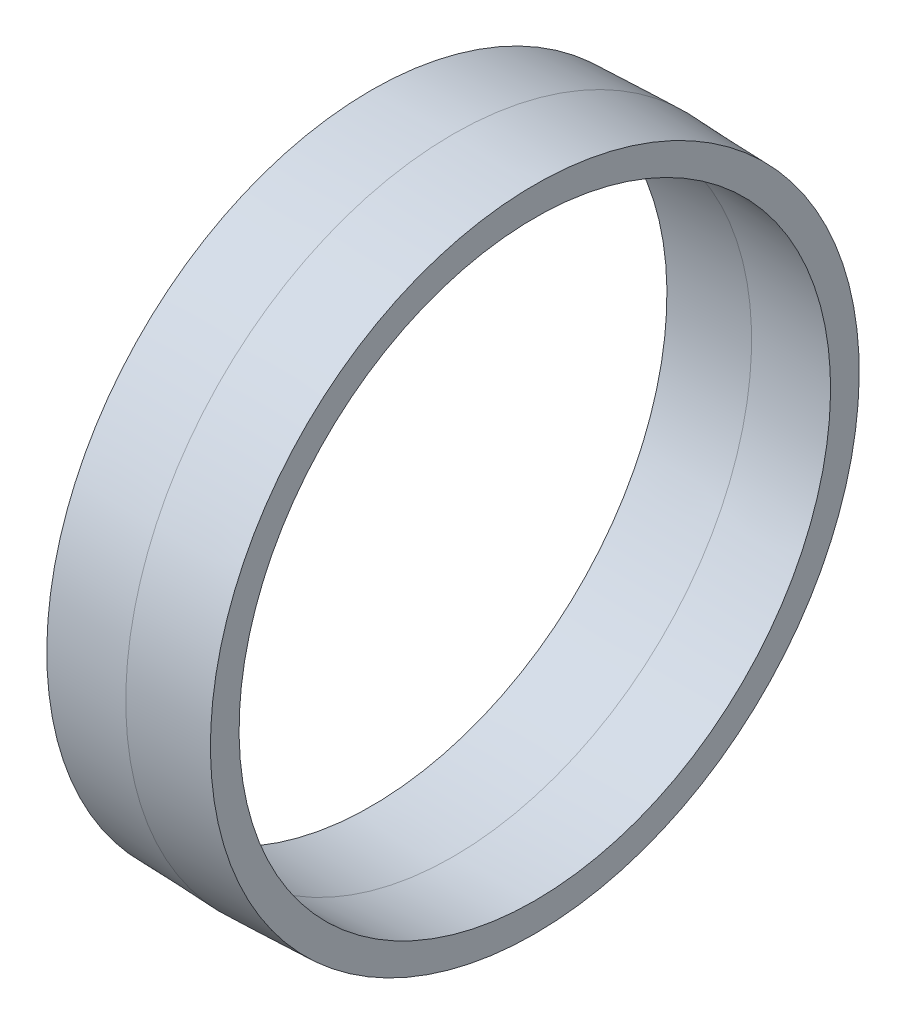
ISO-10303-21;
HEADER;
FILE_DESCRIPTION(('STEP AP214'),'2;1');
FILE_NAME('part.step','',(''),(''),'','','');
FILE_SCHEMA(('AUTOMOTIVE_DESIGN { 1 0 10303 214 1 1 1 1 }'));
ENDSEC;
DATA;
#1=APPLICATION_CONTEXT('core data for automotive mechanical design processes');
#2=APPLICATION_PROTOCOL_DEFINITION('international standard','automotive_design',2000,#1);
#3=PRODUCT_CONTEXT('',#1,'mechanical');
#4=PRODUCT('Part','Part','',(#3));
#5=PRODUCT_RELATED_PRODUCT_CATEGORY('part','',(#4));
#6=PRODUCT_DEFINITION_FORMATION('','',#4);
#7=PRODUCT_DEFINITION_CONTEXT('part definition',#1,'design');
#8=PRODUCT_DEFINITION('design','',#6,#7);
#9=PRODUCT_DEFINITION_SHAPE('','',#8);
#10=(LENGTH_UNIT() NAMED_UNIT(*) SI_UNIT(.MILLI.,.METRE.));
#11=(NAMED_UNIT(*) PLANE_ANGLE_UNIT() SI_UNIT($,.RADIAN.));
#12=(NAMED_UNIT(*) SI_UNIT($,.STERADIAN.) SOLID_ANGLE_UNIT());
#13=UNCERTAINTY_MEASURE_WITH_UNIT(LENGTH_MEASURE(1.E-05),#10,'distance_accuracy_value','');
#14=(GEOMETRIC_REPRESENTATION_CONTEXT(3) GLOBAL_UNCERTAINTY_ASSIGNED_CONTEXT((#13)) GLOBAL_UNIT_ASSIGNED_CONTEXT((#10,
#11,#12)) REPRESENTATION_CONTEXT('',''));
#15=CARTESIAN_POINT('',(0.,0.,0.));
#16=DIRECTION('',(0.,0.,1.));
#17=DIRECTION('',(1.,0.,0.));
#18=AXIS2_PLACEMENT_3D('',#15,#16,#17);
#19=CARTESIAN_POINT('',(-1.22406624605667,0.,0.));
#20=DIRECTION('',(1.,0.,0.));
#21=DIRECTION('',(0.,1.,0.));
#22=AXIS2_PLACEMENT_3D('',#19,#20,#21);
#23=CONICAL_SURFACE('',#22,46.355,0.0349065850398794);
#24=CARTESIAN_POINT('',(-1.22406624605675,0.,0.));
#25=DIRECTION('',(-1.,0.,0.));
#26=DIRECTION('',(0.,-1.,0.));
#27=AXIS2_PLACEMENT_3D('',#24,#25,#26);
#28=CIRCLE('',#27,46.355);
#29=CARTESIAN_POINT('',(-1.22406624605684,-46.355,0.));
#30=VERTEX_POINT('',#29);
#31=EDGE_CURVE('E29',#30,#30,#28,.F.);
#32=ORIENTED_EDGE('',*,*,#31,.T.);
#33=EDGE_LOOP('',(#32));
#34=FACE_BOUND('',#33,.T.);
#35=CARTESIAN_POINT('',(-13.9240662460567,0.,0.));
#36=DIRECTION('',(1.,0.,0.));
#37=DIRECTION('',(0.,1.,0.));
#38=AXIS2_PLACEMENT_3D('',#35,#36,#37);
#39=CIRCLE('',#38,45.9115062274549);
#40=CARTESIAN_POINT('',(-13.9240662460567,45.9115062274549,0.));
#41=VERTEX_POINT('',#40);
#42=EDGE_CURVE('E17',#41,#41,#39,.F.);
#43=ORIENTED_EDGE('',*,*,#42,.T.);
#44=EDGE_LOOP('',(#43));
#45=FACE_BOUND('',#44,.T.);
#46=ADVANCED_FACE('F14',(#34,#45),#23,.F.);
#47=CARTESIAN_POINT('',(-1.22406624605684,0.,0.));
#48=DIRECTION('',(-1.,0.,0.));
#49=DIRECTION('',(0.,-1.,0.));
#50=AXIS2_PLACEMENT_3D('',#47,#48,#49);
#51=CONICAL_SURFACE('',#50,46.355,0.0349065850398788);
#52=CARTESIAN_POINT('',(11.4759337539432,0.,0.));
#53=DIRECTION('',(-1.,0.,0.));
#54=DIRECTION('',(0.,-1.,0.));
#55=AXIS2_PLACEMENT_3D('',#52,#53,#54);
#56=CIRCLE('',#55,45.9115062274549);
#57=CARTESIAN_POINT('',(11.4759337539432,-45.9115062274549,0.));
#58=VERTEX_POINT('',#57);
#59=EDGE_CURVE('E33',#58,#58,#56,.F.);
#60=ORIENTED_EDGE('',*,*,#59,.T.);
#61=EDGE_LOOP('',(#60));
#62=FACE_BOUND('',#61,.T.);
#63=ORIENTED_EDGE('',*,*,#31,.F.);
#64=EDGE_LOOP('',(#63));
#65=FACE_BOUND('',#64,.T.);
#66=ADVANCED_FACE('F44',(#62,#65),#51,.F.);
#67=CARTESIAN_POINT('',(-13.9240662460568,45.9115062274549,0.));
#68=DIRECTION('',(1.,0.,0.));
#69=DIRECTION('',(0.,1.,0.));
#70=AXIS2_PLACEMENT_3D('',#67,#68,#69);
#71=PLANE('',#70);
#72=CARTESIAN_POINT('',(-13.9240662460567,0.,0.));
#73=DIRECTION('',(1.,0.,0.));
#74=DIRECTION('',(0.,1.,0.));
#75=AXIS2_PLACEMENT_3D('',#72,#73,#74);
#76=CIRCLE('',#75,50.3565062274549);
#77=CARTESIAN_POINT('',(-13.9240662460567,50.3565062274549,0.));
#78=VERTEX_POINT('',#77);
#79=EDGE_CURVE('E26',#78,#78,#76,.T.);
#80=ORIENTED_EDGE('',*,*,#79,.F.);
#81=EDGE_LOOP('',(#80));
#82=FACE_BOUND('',#81,.T.);
#83=ORIENTED_EDGE('',*,*,#42,.F.);
#84=EDGE_LOOP('',(#83));
#85=FACE_BOUND('',#84,.T.);
#86=ADVANCED_FACE('F41',(#82,#85),#71,.F.);
#87=CARTESIAN_POINT('',(11.4759337539432,50.3565062274549,0.));
#88=DIRECTION('',(-1.,0.,0.));
#89=DIRECTION('',(0.,-1.,0.));
#90=AXIS2_PLACEMENT_3D('',#87,#88,#89);
#91=PLANE('',#90);
#92=ORIENTED_EDGE('',*,*,#59,.F.);
#93=EDGE_LOOP('',(#92));
#94=FACE_BOUND('',#93,.T.);
#95=CARTESIAN_POINT('',(11.4759337539432,0.,0.));
#96=DIRECTION('',(-1.,0.,0.));
#97=DIRECTION('',(0.,-1.,0.));
#98=AXIS2_PLACEMENT_3D('',#95,#96,#97);
#99=CIRCLE('',#98,50.3565062274549);
#100=CARTESIAN_POINT('',(11.4759337539432,-50.3565062274549,0.));
#101=VERTEX_POINT('',#100);
#102=EDGE_CURVE('E21',#101,#101,#99,.T.);
#103=ORIENTED_EDGE('',*,*,#102,.F.);
#104=EDGE_LOOP('',(#103));
#105=FACE_BOUND('',#104,.T.);
#106=ADVANCED_FACE('F43',(#94,#105),#91,.F.);
#107=CARTESIAN_POINT('',(-1.22406624605671,0.,0.));
#108=DIRECTION('',(1.,0.,0.));
#109=DIRECTION('',(0.,1.,0.));
#110=AXIS2_PLACEMENT_3D('',#107,#108,#109);
#111=CONICAL_SURFACE('',#110,50.8,0.0349065850398795);
#112=CARTESIAN_POINT('',(-1.22406624605675,0.,0.));
#113=DIRECTION('',(-1.,0.,0.));
#114=DIRECTION('',(0.,-1.,0.));
#115=AXIS2_PLACEMENT_3D('',#112,#113,#114);
#116=CIRCLE('',#115,50.8);
#117=CARTESIAN_POINT('',(-1.2240662460568,-50.8,0.));
#118=VERTEX_POINT('',#117);
#119=EDGE_CURVE('E10',#118,#118,#116,.F.);
#120=ORIENTED_EDGE('',*,*,#119,.F.);
#121=EDGE_LOOP('',(#120));
#122=FACE_BOUND('',#121,.T.);
#123=ORIENTED_EDGE('',*,*,#79,.T.);
#124=EDGE_LOOP('',(#123));
#125=FACE_BOUND('',#124,.T.);
#126=ADVANCED_FACE('F52',(#122,#125),#111,.T.);
#127=CARTESIAN_POINT('',(-1.2240662460568,0.,0.));
#128=DIRECTION('',(-1.,0.,0.));
#129=DIRECTION('',(0.,-1.,0.));
#130=AXIS2_PLACEMENT_3D('',#127,#128,#129);
#131=CONICAL_SURFACE('',#130,50.8,0.0349065850398782);
#132=ORIENTED_EDGE('',*,*,#119,.T.);
#133=EDGE_LOOP('',(#132));
#134=FACE_BOUND('',#133,.T.);
#135=ORIENTED_EDGE('',*,*,#102,.T.);
#136=EDGE_LOOP('',(#135));
#137=FACE_BOUND('',#136,.T.);
#138=ADVANCED_FACE('F56',(#134,#137),#131,.T.);
#139=CLOSED_SHELL('',(#46,#66,#86,#106,#126,#138));
#140=MANIFOLD_SOLID_BREP('B1',#139);
#141=ADVANCED_BREP_SHAPE_REPRESENTATION('',(#18,#140),#14);
#142=SHAPE_DEFINITION_REPRESENTATION(#9,#141);
ENDSEC;
END-ISO-10303-21;
